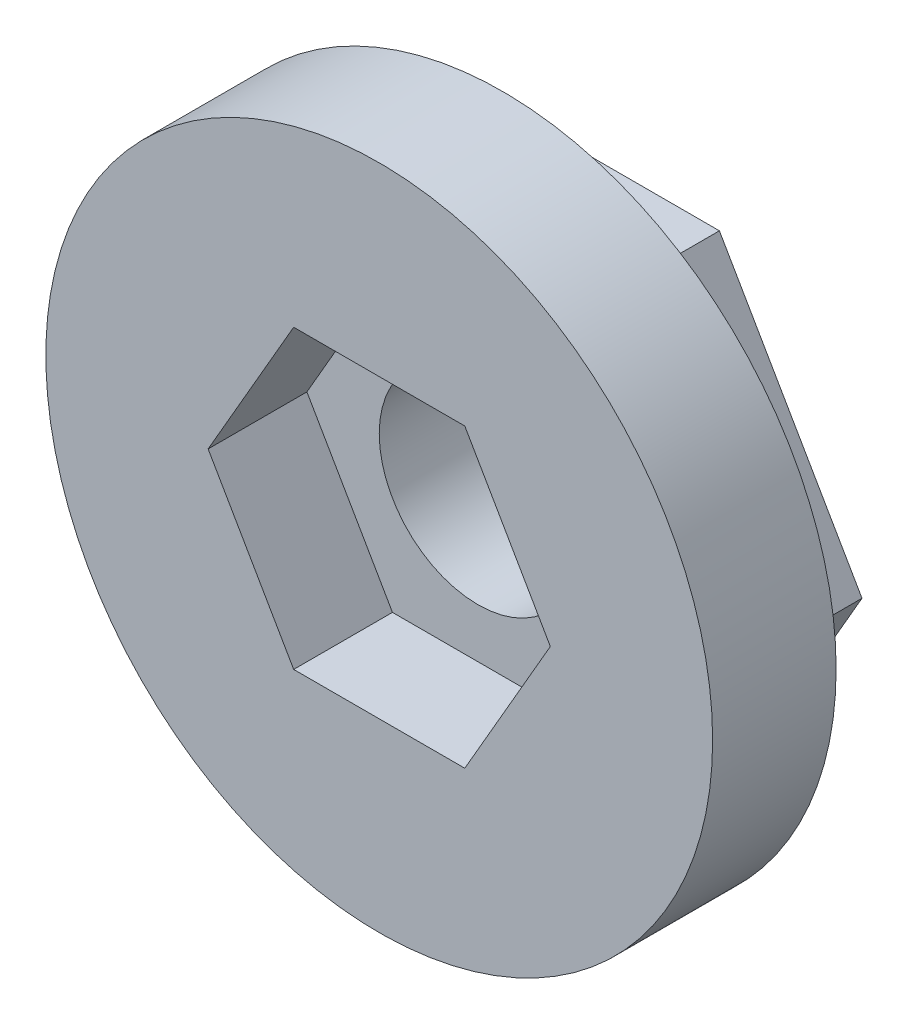
ISO-10303-21;
HEADER;
FILE_DESCRIPTION(('STEP AP214'),'2;1');
FILE_NAME('part.step','',(''),(''),'','','');
FILE_SCHEMA(('AUTOMOTIVE_DESIGN { 1 0 10303 214 1 1 1 1 }'));
ENDSEC;
DATA;
#1=APPLICATION_CONTEXT('core data for automotive mechanical design processes');
#2=APPLICATION_PROTOCOL_DEFINITION('international standard','automotive_design',2000,#1);
#3=PRODUCT_CONTEXT('',#1,'mechanical');
#4=PRODUCT('Part','Part','',(#3));
#5=PRODUCT_RELATED_PRODUCT_CATEGORY('part','',(#4));
#6=PRODUCT_DEFINITION_FORMATION('','',#4);
#7=PRODUCT_DEFINITION_CONTEXT('part definition',#1,'design');
#8=PRODUCT_DEFINITION('design','',#6,#7);
#9=PRODUCT_DEFINITION_SHAPE('','',#8);
#10=(LENGTH_UNIT() NAMED_UNIT(*) SI_UNIT(.MILLI.,.METRE.));
#11=(NAMED_UNIT(*) PLANE_ANGLE_UNIT() SI_UNIT($,.RADIAN.));
#12=(NAMED_UNIT(*) SI_UNIT($,.STERADIAN.) SOLID_ANGLE_UNIT());
#13=UNCERTAINTY_MEASURE_WITH_UNIT(LENGTH_MEASURE(1.E-05),#10,'distance_accuracy_value','');
#14=(GEOMETRIC_REPRESENTATION_CONTEXT(3) GLOBAL_UNCERTAINTY_ASSIGNED_CONTEXT((#13)) GLOBAL_UNIT_ASSIGNED_CONTEXT((#10,
#11,#12)) REPRESENTATION_CONTEXT('',''));
#15=CARTESIAN_POINT('',(0.,0.,0.));
#16=DIRECTION('',(0.,0.,1.));
#17=DIRECTION('',(1.,0.,0.));
#18=AXIS2_PLACEMENT_3D('',#15,#16,#17);
#19=CARTESIAN_POINT('',(5.77350269189626,-9.99999999999999,3.));
#20=DIRECTION('',(-0.866025403784438,0.5,0.));
#21=DIRECTION('',(-0.5,-0.866025403784439,0.));
#22=AXIS2_PLACEMENT_3D('',#19,#20,#21);
#23=PLANE('',#22);
#24=DIRECTION('',(0.5,0.866025403784439,0.));
#25=VECTOR('',#24,1.);
#26=CARTESIAN_POINT('',(5.77350269189626,-9.99999999999999,0.));
#27=LINE('',#26,#25);
#28=CARTESIAN_POINT('',(5.77350269189626,-9.99999999999999,0.));
#29=VERTEX_POINT('',#28);
#30=CARTESIAN_POINT('',(11.5470053837925,0.,0.));
#31=VERTEX_POINT('',#30);
#32=EDGE_CURVE('E133',#29,#31,#27,.T.);
#33=ORIENTED_EDGE('',*,*,#32,.T.);
#34=DIRECTION('',(0.,0.,-1.));
#35=VECTOR('',#34,1.);
#36=CARTESIAN_POINT('',(11.5470053837925,0.,3.));
#37=LINE('',#36,#35);
#38=CARTESIAN_POINT('',(11.5470053837925,0.,3.));
#39=VERTEX_POINT('',#38);
#40=EDGE_CURVE('E11',#39,#31,#37,.T.);
#41=ORIENTED_EDGE('',*,*,#40,.F.);
#42=DIRECTION('',(0.5,0.866025403784439,0.));
#43=VECTOR('',#42,1.);
#44=CARTESIAN_POINT('',(5.77350269189626,-9.99999999999999,3.));
#45=LINE('',#44,#43);
#46=CARTESIAN_POINT('',(5.77350269189626,-9.99999999999999,3.));
#47=VERTEX_POINT('',#46);
#48=EDGE_CURVE('E125',#47,#39,#45,.T.);
#49=ORIENTED_EDGE('',*,*,#48,.F.);
#50=DIRECTION('',(0.,0.,-1.));
#51=VECTOR('',#50,1.);
#52=CARTESIAN_POINT('',(5.77350269189626,-9.99999999999999,3.));
#53=LINE('',#52,#51);
#54=EDGE_CURVE('E132',#47,#29,#53,.T.);
#55=ORIENTED_EDGE('',*,*,#54,.T.);
#56=EDGE_LOOP('',(#33,#41,#49,#55));
#57=FACE_BOUND('',#56,.T.);
#58=ADVANCED_FACE('F33',(#57),#23,.F.);
#59=CARTESIAN_POINT('',(11.5470053837925,0.,3.));
#60=DIRECTION('',(-0.866025403784438,-0.5,0.));
#61=DIRECTION('',(0.5,-0.866025403784438,0.));
#62=AXIS2_PLACEMENT_3D('',#59,#60,#61);
#63=PLANE('',#62);
#64=DIRECTION('',(-0.5,0.866025403784438,0.));
#65=VECTOR('',#64,1.);
#66=CARTESIAN_POINT('',(11.5470053837925,0.,0.));
#67=LINE('',#66,#65);
#68=CARTESIAN_POINT('',(5.77350269189625,10.,0.));
#69=VERTEX_POINT('',#68);
#70=EDGE_CURVE('E136',#31,#69,#67,.T.);
#71=ORIENTED_EDGE('',*,*,#70,.T.);
#72=DIRECTION('',(0.,0.,-1.));
#73=VECTOR('',#72,1.);
#74=CARTESIAN_POINT('',(5.77350269189625,10.,3.));
#75=LINE('',#74,#73);
#76=CARTESIAN_POINT('',(5.77350269189625,10.,3.));
#77=VERTEX_POINT('',#76);
#78=EDGE_CURVE('E41',#77,#69,#75,.T.);
#79=ORIENTED_EDGE('',*,*,#78,.F.);
#80=DIRECTION('',(-0.5,0.866025403784438,0.));
#81=VECTOR('',#80,1.);
#82=CARTESIAN_POINT('',(11.5470053837925,0.,3.));
#83=LINE('',#82,#81);
#84=EDGE_CURVE('E92',#39,#77,#83,.T.);
#85=ORIENTED_EDGE('',*,*,#84,.F.);
#86=ORIENTED_EDGE('',*,*,#40,.T.);
#87=EDGE_LOOP('',(#71,#79,#85,#86));
#88=FACE_BOUND('',#87,.T.);
#89=ADVANCED_FACE('F285',(#88),#63,.F.);
#90=CARTESIAN_POINT('',(5.77350269189625,10.,3.));
#91=DIRECTION('',(0.,-1.,0.));
#92=DIRECTION('',(0.,0.,-1.));
#93=AXIS2_PLACEMENT_3D('',#90,#91,#92);
#94=PLANE('',#93);
#95=DIRECTION('',(-1.,0.,0.));
#96=VECTOR('',#95,1.);
#97=CARTESIAN_POINT('',(5.77350269189625,10.,0.));
#98=LINE('',#97,#96);
#99=CARTESIAN_POINT('',(-5.77350269189626,10.,0.));
#100=VERTEX_POINT('',#99);
#101=EDGE_CURVE('E108',#69,#100,#98,.T.);
#102=ORIENTED_EDGE('',*,*,#101,.T.);
#103=DIRECTION('',(0.,0.,-1.));
#104=VECTOR('',#103,1.);
#105=CARTESIAN_POINT('',(-5.77350269189626,10.,3.));
#106=LINE('',#105,#104);
#107=CARTESIAN_POINT('',(-5.77350269189626,10.,3.));
#108=VERTEX_POINT('',#107);
#109=EDGE_CURVE('E101',#108,#100,#106,.T.);
#110=ORIENTED_EDGE('',*,*,#109,.F.);
#111=DIRECTION('',(-1.,0.,0.));
#112=VECTOR('',#111,1.);
#113=CARTESIAN_POINT('',(5.77350269189625,10.,3.));
#114=LINE('',#113,#112);
#115=EDGE_CURVE('E106',#77,#108,#114,.T.);
#116=ORIENTED_EDGE('',*,*,#115,.F.);
#117=ORIENTED_EDGE('',*,*,#78,.T.);
#118=EDGE_LOOP('',(#102,#110,#116,#117));
#119=FACE_BOUND('',#118,.T.);
#120=ADVANCED_FACE('F103',(#119),#94,.F.);
#121=CARTESIAN_POINT('',(-5.77350269189626,10.,3.));
#122=DIRECTION('',(0.866025403784438,-0.5,0.));
#123=DIRECTION('',(0.5,0.866025403784439,0.));
#124=AXIS2_PLACEMENT_3D('',#121,#122,#123);
#125=PLANE('',#124);
#126=DIRECTION('',(-0.5,-0.866025403784439,0.));
#127=VECTOR('',#126,1.);
#128=CARTESIAN_POINT('',(-5.77350269189626,10.,0.));
#129=LINE('',#128,#127);
#130=CARTESIAN_POINT('',(-11.5470053837925,0.,0.));
#131=VERTEX_POINT('',#130);
#132=EDGE_CURVE('E140',#100,#131,#129,.T.);
#133=ORIENTED_EDGE('',*,*,#132,.T.);
#134=DIRECTION('',(0.,0.,-1.));
#135=VECTOR('',#134,1.);
#136=CARTESIAN_POINT('',(-11.5470053837925,0.,3.));
#137=LINE('',#136,#135);
#138=CARTESIAN_POINT('',(-11.5470053837925,0.,3.));
#139=VERTEX_POINT('',#138);
#140=EDGE_CURVE('E111',#139,#131,#137,.T.);
#141=ORIENTED_EDGE('',*,*,#140,.F.);
#142=DIRECTION('',(-0.5,-0.866025403784439,0.));
#143=VECTOR('',#142,1.);
#144=CARTESIAN_POINT('',(-5.77350269189626,10.,3.));
#145=LINE('',#144,#143);
#146=EDGE_CURVE('E114',#108,#139,#145,.T.);
#147=ORIENTED_EDGE('',*,*,#146,.F.);
#148=ORIENTED_EDGE('',*,*,#109,.T.);
#149=EDGE_LOOP('',(#133,#141,#147,#148));
#150=FACE_BOUND('',#149,.T.);
#151=ADVANCED_FACE('F115',(#150),#125,.F.);
#152=CARTESIAN_POINT('',(-11.5470053837925,0.,3.));
#153=DIRECTION('',(0.866025403784438,0.5,0.));
#154=DIRECTION('',(-0.5,0.866025403784438,0.));
#155=AXIS2_PLACEMENT_3D('',#152,#153,#154);
#156=PLANE('',#155);
#157=DIRECTION('',(0.5,-0.866025403784438,0.));
#158=VECTOR('',#157,1.);
#159=CARTESIAN_POINT('',(-11.5470053837925,0.,0.));
#160=LINE('',#159,#158);
#161=CARTESIAN_POINT('',(-5.77350269189626,-10.,0.));
#162=VERTEX_POINT('',#161);
#163=EDGE_CURVE('E142',#131,#162,#160,.T.);
#164=ORIENTED_EDGE('',*,*,#163,.T.);
#165=DIRECTION('',(0.,0.,-1.));
#166=VECTOR('',#165,1.);
#167=CARTESIAN_POINT('',(-5.77350269189626,-10.,3.));
#168=LINE('',#167,#166);
#169=CARTESIAN_POINT('',(-5.77350269189626,-10.,3.));
#170=VERTEX_POINT('',#169);
#171=EDGE_CURVE('E57',#170,#162,#168,.T.);
#172=ORIENTED_EDGE('',*,*,#171,.F.);
#173=DIRECTION('',(0.5,-0.866025403784438,0.));
#174=VECTOR('',#173,1.);
#175=CARTESIAN_POINT('',(-11.5470053837925,0.,3.));
#176=LINE('',#175,#174);
#177=EDGE_CURVE('E119',#139,#170,#176,.T.);
#178=ORIENTED_EDGE('',*,*,#177,.F.);
#179=ORIENTED_EDGE('',*,*,#140,.T.);
#180=EDGE_LOOP('',(#164,#172,#178,#179));
#181=FACE_BOUND('',#180,.T.);
#182=ADVANCED_FACE('F152',(#181),#156,.F.);
#183=CARTESIAN_POINT('',(-5.77350269189626,-10.,3.));
#184=DIRECTION('',(0.,1.,0.));
#185=DIRECTION('',(-1.,0.,0.));
#186=AXIS2_PLACEMENT_3D('',#183,#184,#185);
#187=PLANE('',#186);
#188=DIRECTION('',(1.,0.,0.));
#189=VECTOR('',#188,1.);
#190=CARTESIAN_POINT('',(-5.77350269189626,-10.,0.));
#191=LINE('',#190,#189);
#192=EDGE_CURVE('E84',#162,#29,#191,.T.);
#193=ORIENTED_EDGE('',*,*,#192,.T.);
#194=ORIENTED_EDGE('',*,*,#54,.F.);
#195=DIRECTION('',(1.,0.,0.));
#196=VECTOR('',#195,1.);
#197=CARTESIAN_POINT('',(-5.77350269189626,-10.,3.));
#198=LINE('',#197,#196);
#199=EDGE_CURVE('E130',#170,#47,#198,.T.);
#200=ORIENTED_EDGE('',*,*,#199,.F.);
#201=ORIENTED_EDGE('',*,*,#171,.T.);
#202=EDGE_LOOP('',(#193,#194,#200,#201));
#203=FACE_BOUND('',#202,.T.);
#204=ADVANCED_FACE('F155',(#203),#187,.F.);
#205=CARTESIAN_POINT('',(0.,0.,0.));
#206=DIRECTION('',(0.,0.,1.));
#207=DIRECTION('',(1.,0.,0.));
#208=AXIS2_PLACEMENT_3D('',#205,#206,#207);
#209=PLANE('',#208);
#210=CARTESIAN_POINT('',(0.,0.,0.));
#211=DIRECTION('',(0.,0.,-1.));
#212=DIRECTION('',(-1.,0.,0.));
#213=AXIS2_PLACEMENT_3D('',#210,#211,#212);
#214=CIRCLE('',#213,4.);
#215=CARTESIAN_POINT('',(-4.,0.,0.));
#216=VERTEX_POINT('',#215);
#217=EDGE_CURVE('E213',#216,#216,#214,.T.);
#218=ORIENTED_EDGE('',*,*,#217,.F.);
#219=EDGE_LOOP('',(#218));
#220=FACE_BOUND('',#219,.T.);
#221=ORIENTED_EDGE('',*,*,#32,.F.);
#222=ORIENTED_EDGE('',*,*,#192,.F.);
#223=ORIENTED_EDGE('',*,*,#163,.F.);
#224=ORIENTED_EDGE('',*,*,#132,.F.);
#225=ORIENTED_EDGE('',*,*,#101,.F.);
#226=ORIENTED_EDGE('',*,*,#70,.F.);
#227=EDGE_LOOP('',(#221,#222,#223,#224,#225,#226));
#228=FACE_BOUND('',#227,.T.);
#229=ADVANCED_FACE('F150',(#220,#228),#209,.F.);
#230=CARTESIAN_POINT('',(0.,0.,3.));
#231=DIRECTION('',(0.,0.,1.));
#232=DIRECTION('',(1.,0.,0.));
#233=AXIS2_PLACEMENT_3D('',#230,#231,#232);
#234=PLANE('',#233);
#235=CARTESIAN_POINT('',(0.,0.,3.));
#236=DIRECTION('',(0.,0.,1.));
#237=DIRECTION('',(1.,0.,0.));
#238=AXIS2_PLACEMENT_3D('',#235,#236,#237);
#239=CIRCLE('',#238,13.5);
#240=CARTESIAN_POINT('',(13.5,0.,3.));
#241=VERTEX_POINT('',#240);
#242=EDGE_CURVE('E158',#241,#241,#239,.T.);
#243=ORIENTED_EDGE('',*,*,#242,.F.);
#244=EDGE_LOOP('',(#243));
#245=FACE_BOUND('',#244,.T.);
#246=ORIENTED_EDGE('',*,*,#199,.T.);
#247=ORIENTED_EDGE('',*,*,#48,.T.);
#248=ORIENTED_EDGE('',*,*,#84,.T.);
#249=ORIENTED_EDGE('',*,*,#115,.T.);
#250=ORIENTED_EDGE('',*,*,#146,.T.);
#251=ORIENTED_EDGE('',*,*,#177,.T.);
#252=EDGE_LOOP('',(#246,#247,#248,#249,#250,#251));
#253=FACE_BOUND('',#252,.T.);
#254=ADVANCED_FACE('F122',(#245,#253),#234,.F.);
#255=CARTESIAN_POINT('',(0.,0.,8.));
#256=DIRECTION('',(0.,0.,-1.));
#257=DIRECTION('',(-1.,0.,0.));
#258=AXIS2_PLACEMENT_3D('',#255,#256,#257);
#259=CYLINDRICAL_SURFACE('',#258,13.5);
#260=CARTESIAN_POINT('',(0.,0.,8.));
#261=DIRECTION('',(0.,0.,1.));
#262=DIRECTION('',(1.,0.,0.));
#263=AXIS2_PLACEMENT_3D('',#260,#261,#262);
#264=CIRCLE('',#263,13.5);
#265=CARTESIAN_POINT('',(13.5,0.,8.));
#266=VERTEX_POINT('',#265);
#267=EDGE_CURVE('E137',#266,#266,#264,.T.);
#268=ORIENTED_EDGE('',*,*,#267,.F.);
#269=EDGE_LOOP('',(#268));
#270=FACE_BOUND('',#269,.T.);
#271=ORIENTED_EDGE('',*,*,#242,.T.);
#272=EDGE_LOOP('',(#271));
#273=FACE_BOUND('',#272,.T.);
#274=ADVANCED_FACE('F303',(#270,#273),#259,.T.);
#275=CARTESIAN_POINT('',(0.,0.,8.));
#276=DIRECTION('',(0.,0.,1.));
#277=DIRECTION('',(1.,0.,0.));
#278=AXIS2_PLACEMENT_3D('',#275,#276,#277);
#279=PLANE('',#278);
#280=DIRECTION('',(1.,0.,0.));
#281=VECTOR('',#280,1.);
#282=CARTESIAN_POINT('',(-3.46410161513775,-6.,8.));
#283=LINE('',#282,#281);
#284=CARTESIAN_POINT('',(-3.46410161513775,-6.,8.));
#285=VERTEX_POINT('',#284);
#286=CARTESIAN_POINT('',(3.46410161513775,-6.,8.));
#287=VERTEX_POINT('',#286);
#288=EDGE_CURVE('E48',#285,#287,#283,.T.);
#289=ORIENTED_EDGE('',*,*,#288,.F.);
#290=DIRECTION('',(0.5,-0.866025403784438,0.));
#291=VECTOR('',#290,1.);
#292=CARTESIAN_POINT('',(-6.92820323027551,0.,8.));
#293=LINE('',#292,#291);
#294=CARTESIAN_POINT('',(-6.92820323027551,0.,8.));
#295=VERTEX_POINT('',#294);
#296=EDGE_CURVE('E180',#295,#285,#293,.T.);
#297=ORIENTED_EDGE('',*,*,#296,.F.);
#298=DIRECTION('',(-0.5,-0.866025403784439,0.));
#299=VECTOR('',#298,1.);
#300=CARTESIAN_POINT('',(-3.46410161513775,6.,8.));
#301=LINE('',#300,#299);
#302=CARTESIAN_POINT('',(-3.46410161513775,6.,8.));
#303=VERTEX_POINT('',#302);
#304=EDGE_CURVE('E184',#303,#295,#301,.T.);
#305=ORIENTED_EDGE('',*,*,#304,.F.);
#306=DIRECTION('',(-1.,0.,0.));
#307=VECTOR('',#306,1.);
#308=CARTESIAN_POINT('',(3.46410161513775,6.,8.));
#309=LINE('',#308,#307);
#310=CARTESIAN_POINT('',(3.46410161513775,6.,8.));
#311=VERTEX_POINT('',#310);
#312=EDGE_CURVE('E187',#311,#303,#309,.T.);
#313=ORIENTED_EDGE('',*,*,#312,.F.);
#314=DIRECTION('',(-0.5,0.866025403784438,0.));
#315=VECTOR('',#314,1.);
#316=CARTESIAN_POINT('',(6.92820323027551,0.,8.));
#317=LINE('',#316,#315);
#318=CARTESIAN_POINT('',(6.92820323027551,0.,8.));
#319=VERTEX_POINT('',#318);
#320=EDGE_CURVE('E190',#319,#311,#317,.T.);
#321=ORIENTED_EDGE('',*,*,#320,.F.);
#322=DIRECTION('',(0.5,0.866025403784439,0.));
#323=VECTOR('',#322,1.);
#324=CARTESIAN_POINT('',(3.46410161513775,-6.,8.));
#325=LINE('',#324,#323);
#326=EDGE_CURVE('E193',#287,#319,#325,.T.);
#327=ORIENTED_EDGE('',*,*,#326,.F.);
#328=EDGE_LOOP('',(#289,#297,#305,#313,#321,#327));
#329=FACE_BOUND('',#328,.T.);
#330=ORIENTED_EDGE('',*,*,#267,.T.);
#331=EDGE_LOOP('',(#330));
#332=FACE_BOUND('',#331,.T.);
#333=ADVANCED_FACE('F260',(#329,#332),#279,.T.);
#334=CARTESIAN_POINT('',(-3.46410161513775,-6.,4.));
#335=DIRECTION('',(0.,-1.,0.));
#336=DIRECTION('',(1.,0.,0.));
#337=AXIS2_PLACEMENT_3D('',#334,#335,#336);
#338=PLANE('',#337);
#339=ORIENTED_EDGE('',*,*,#288,.T.);
#340=DIRECTION('',(0.,0.,1.));
#341=VECTOR('',#340,1.);
#342=CARTESIAN_POINT('',(3.46410161513775,-6.,4.));
#343=LINE('',#342,#341);
#344=CARTESIAN_POINT('',(3.46410161513775,-6.,4.));
#345=VERTEX_POINT('',#344);
#346=EDGE_CURVE('E164',#345,#287,#343,.T.);
#347=ORIENTED_EDGE('',*,*,#346,.F.);
#348=DIRECTION('',(1.,0.,0.));
#349=VECTOR('',#348,1.);
#350=CARTESIAN_POINT('',(-3.46410161513775,-6.,4.));
#351=LINE('',#350,#349);
#352=CARTESIAN_POINT('',(-3.46410161513775,-6.,4.));
#353=VERTEX_POINT('',#352);
#354=EDGE_CURVE('E183',#353,#345,#351,.T.);
#355=ORIENTED_EDGE('',*,*,#354,.F.);
#356=DIRECTION('',(0.,0.,1.));
#357=VECTOR('',#356,1.);
#358=CARTESIAN_POINT('',(-3.46410161513775,-6.,4.));
#359=LINE('',#358,#357);
#360=EDGE_CURVE('E161',#353,#285,#359,.T.);
#361=ORIENTED_EDGE('',*,*,#360,.T.);
#362=EDGE_LOOP('',(#339,#347,#355,#361));
#363=FACE_BOUND('',#362,.T.);
#364=ADVANCED_FACE('F234',(#363),#338,.F.);
#365=CARTESIAN_POINT('',(-6.92820323027551,0.,4.));
#366=DIRECTION('',(-0.866025403784438,-0.5,0.));
#367=DIRECTION('',(0.5,-0.866025403784438,0.));
#368=AXIS2_PLACEMENT_3D('',#365,#366,#367);
#369=PLANE('',#368);
#370=ORIENTED_EDGE('',*,*,#296,.T.);
#371=ORIENTED_EDGE('',*,*,#360,.F.);
#372=DIRECTION('',(0.5,-0.866025403784438,0.));
#373=VECTOR('',#372,1.);
#374=CARTESIAN_POINT('',(-6.92820323027551,0.,4.));
#375=LINE('',#374,#373);
#376=CARTESIAN_POINT('',(-6.92820323027551,0.,4.));
#377=VERTEX_POINT('',#376);
#378=EDGE_CURVE('E167',#377,#353,#375,.T.);
#379=ORIENTED_EDGE('',*,*,#378,.F.);
#380=DIRECTION('',(0.,0.,1.));
#381=VECTOR('',#380,1.);
#382=CARTESIAN_POINT('',(-6.92820323027551,0.,4.));
#383=LINE('',#382,#381);
#384=EDGE_CURVE('E176',#377,#295,#383,.T.);
#385=ORIENTED_EDGE('',*,*,#384,.T.);
#386=EDGE_LOOP('',(#370,#371,#379,#385));
#387=FACE_BOUND('',#386,.T.);
#388=ADVANCED_FACE('F251',(#387),#369,.F.);
#389=CARTESIAN_POINT('',(-3.46410161513775,6.,4.));
#390=DIRECTION('',(-0.866025403784439,0.5,0.));
#391=DIRECTION('',(-0.5,-0.866025403784439,0.));
#392=AXIS2_PLACEMENT_3D('',#389,#390,#391);
#393=PLANE('',#392);
#394=ORIENTED_EDGE('',*,*,#304,.T.);
#395=ORIENTED_EDGE('',*,*,#384,.F.);
#396=DIRECTION('',(-0.5,-0.866025403784439,0.));
#397=VECTOR('',#396,1.);
#398=CARTESIAN_POINT('',(-3.46410161513775,6.,4.));
#399=LINE('',#398,#397);
#400=CARTESIAN_POINT('',(-3.46410161513775,6.,4.));
#401=VERTEX_POINT('',#400);
#402=EDGE_CURVE('E199',#401,#377,#399,.T.);
#403=ORIENTED_EDGE('',*,*,#402,.F.);
#404=DIRECTION('',(0.,0.,1.));
#405=VECTOR('',#404,1.);
#406=CARTESIAN_POINT('',(-3.46410161513775,6.,4.));
#407=LINE('',#406,#405);
#408=EDGE_CURVE('E173',#401,#303,#407,.T.);
#409=ORIENTED_EDGE('',*,*,#408,.T.);
#410=EDGE_LOOP('',(#394,#395,#403,#409));
#411=FACE_BOUND('',#410,.T.);
#412=ADVANCED_FACE('F256',(#411),#393,.F.);
#413=CARTESIAN_POINT('',(3.46410161513775,6.,4.));
#414=DIRECTION('',(0.,1.,0.));
#415=DIRECTION('',(0.,0.,1.));
#416=AXIS2_PLACEMENT_3D('',#413,#414,#415);
#417=PLANE('',#416);
#418=ORIENTED_EDGE('',*,*,#312,.T.);
#419=ORIENTED_EDGE('',*,*,#408,.F.);
#420=DIRECTION('',(-1.,0.,0.));
#421=VECTOR('',#420,1.);
#422=CARTESIAN_POINT('',(3.46410161513775,6.,4.));
#423=LINE('',#422,#421);
#424=CARTESIAN_POINT('',(3.46410161513775,6.,4.));
#425=VERTEX_POINT('',#424);
#426=EDGE_CURVE('E202',#425,#401,#423,.T.);
#427=ORIENTED_EDGE('',*,*,#426,.F.);
#428=DIRECTION('',(0.,0.,1.));
#429=VECTOR('',#428,1.);
#430=CARTESIAN_POINT('',(3.46410161513775,6.,4.));
#431=LINE('',#430,#429);
#432=EDGE_CURVE('E170',#425,#311,#431,.T.);
#433=ORIENTED_EDGE('',*,*,#432,.T.);
#434=EDGE_LOOP('',(#418,#419,#427,#433));
#435=FACE_BOUND('',#434,.T.);
#436=ADVANCED_FACE('F275',(#435),#417,.F.);
#437=CARTESIAN_POINT('',(6.92820323027551,0.,4.));
#438=DIRECTION('',(0.866025403784439,0.5,0.));
#439=DIRECTION('',(-0.5,0.866025403784438,0.));
#440=AXIS2_PLACEMENT_3D('',#437,#438,#439);
#441=PLANE('',#440);
#442=ORIENTED_EDGE('',*,*,#320,.T.);
#443=ORIENTED_EDGE('',*,*,#432,.F.);
#444=DIRECTION('',(-0.5,0.866025403784438,0.));
#445=VECTOR('',#444,1.);
#446=CARTESIAN_POINT('',(6.92820323027551,0.,4.));
#447=LINE('',#446,#445);
#448=CARTESIAN_POINT('',(6.92820323027551,0.,4.));
#449=VERTEX_POINT('',#448);
#450=EDGE_CURVE('E205',#449,#425,#447,.T.);
#451=ORIENTED_EDGE('',*,*,#450,.F.);
#452=DIRECTION('',(0.,0.,1.));
#453=VECTOR('',#452,1.);
#454=CARTESIAN_POINT('',(6.92820323027551,0.,4.));
#455=LINE('',#454,#453);
#456=EDGE_CURVE('E166',#449,#319,#455,.T.);
#457=ORIENTED_EDGE('',*,*,#456,.T.);
#458=EDGE_LOOP('',(#442,#443,#451,#457));
#459=FACE_BOUND('',#458,.T.);
#460=ADVANCED_FACE('F271',(#459),#441,.F.);
#461=CARTESIAN_POINT('',(3.46410161513775,-6.,4.));
#462=DIRECTION('',(0.866025403784439,-0.5,0.));
#463=DIRECTION('',(0.5,0.866025403784439,0.));
#464=AXIS2_PLACEMENT_3D('',#461,#462,#463);
#465=PLANE('',#464);
#466=ORIENTED_EDGE('',*,*,#326,.T.);
#467=ORIENTED_EDGE('',*,*,#456,.F.);
#468=DIRECTION('',(0.5,0.866025403784439,0.));
#469=VECTOR('',#468,1.);
#470=CARTESIAN_POINT('',(3.46410161513775,-6.,4.));
#471=LINE('',#470,#469);
#472=EDGE_CURVE('E208',#345,#449,#471,.T.);
#473=ORIENTED_EDGE('',*,*,#472,.F.);
#474=ORIENTED_EDGE('',*,*,#346,.T.);
#475=EDGE_LOOP('',(#466,#467,#473,#474));
#476=FACE_BOUND('',#475,.T.);
#477=ADVANCED_FACE('F225',(#476),#465,.F.);
#478=CARTESIAN_POINT('',(0.,0.,4.));
#479=DIRECTION('',(0.,0.,1.));
#480=DIRECTION('',(1.,0.,0.));
#481=AXIS2_PLACEMENT_3D('',#478,#479,#480);
#482=PLANE('',#481);
#483=CARTESIAN_POINT('',(0.,0.,4.));
#484=DIRECTION('',(0.,0.,1.));
#485=DIRECTION('',(1.,0.,0.));
#486=AXIS2_PLACEMENT_3D('',#483,#484,#485);
#487=CIRCLE('',#486,4.);
#488=CARTESIAN_POINT('',(4.,0.,4.));
#489=VERTEX_POINT('',#488);
#490=EDGE_CURVE('E36',#489,#489,#487,.T.);
#491=ORIENTED_EDGE('',*,*,#490,.F.);
#492=EDGE_LOOP('',(#491));
#493=FACE_BOUND('',#492,.T.);
#494=ORIENTED_EDGE('',*,*,#354,.T.);
#495=ORIENTED_EDGE('',*,*,#472,.T.);
#496=ORIENTED_EDGE('',*,*,#450,.T.);
#497=ORIENTED_EDGE('',*,*,#426,.T.);
#498=ORIENTED_EDGE('',*,*,#402,.T.);
#499=ORIENTED_EDGE('',*,*,#378,.T.);
#500=EDGE_LOOP('',(#494,#495,#496,#497,#498,#499));
#501=FACE_BOUND('',#500,.T.);
#502=ADVANCED_FACE('F222',(#493,#501),#482,.T.);
#503=CARTESIAN_POINT('',(0.,0.,8.));
#504=DIRECTION('',(0.,0.,-1.));
#505=DIRECTION('',(-1.,0.,0.));
#506=AXIS2_PLACEMENT_3D('',#503,#504,#505);
#507=CYLINDRICAL_SURFACE('',#506,4.);
#508=ORIENTED_EDGE('',*,*,#490,.T.);
#509=EDGE_LOOP('',(#508));
#510=FACE_BOUND('',#509,.T.);
#511=ORIENTED_EDGE('',*,*,#217,.T.);
#512=EDGE_LOOP('',(#511));
#513=FACE_BOUND('',#512,.T.);
#514=ADVANCED_FACE('F220',(#510,#513),#507,.F.);
#515=CLOSED_SHELL('',(#58,#89,#120,#151,#182,#204,#229,#254,#274,#333,#364,#388,#412,#436,#460,
#477,#502,#514));
#516=MANIFOLD_SOLID_BREP('B2',#515);
#517=ADVANCED_BREP_SHAPE_REPRESENTATION('',(#18,#516),#14);
#518=SHAPE_DEFINITION_REPRESENTATION(#9,#517);
ENDSEC;
END-ISO-10303-21;
